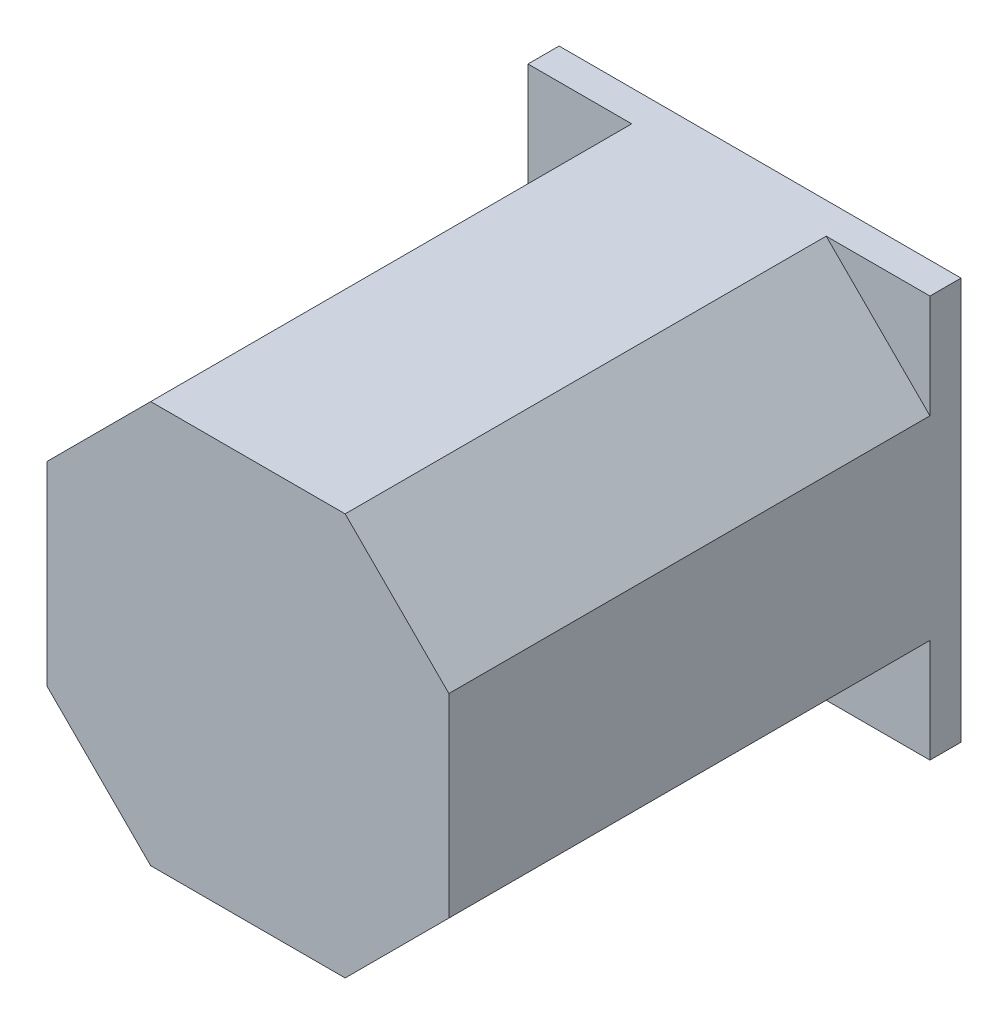
ISO-10303-21;
HEADER;
FILE_DESCRIPTION(('STEP AP214'),'2;1');
FILE_NAME('part.step','',(''),(''),'','','');
FILE_SCHEMA(('AUTOMOTIVE_DESIGN { 1 0 10303 214 1 1 1 1 }'));
ENDSEC;
DATA;
#1=APPLICATION_CONTEXT('core data for automotive mechanical design processes');
#2=APPLICATION_PROTOCOL_DEFINITION('international standard','automotive_design',2000,#1);
#3=PRODUCT_CONTEXT('',#1,'mechanical');
#4=PRODUCT('Part','Part','',(#3));
#5=PRODUCT_RELATED_PRODUCT_CATEGORY('part','',(#4));
#6=PRODUCT_DEFINITION_FORMATION('','',#4);
#7=PRODUCT_DEFINITION_CONTEXT('part definition',#1,'design');
#8=PRODUCT_DEFINITION('design','',#6,#7);
#9=PRODUCT_DEFINITION_SHAPE('','',#8);
#10=(LENGTH_UNIT() NAMED_UNIT(*) SI_UNIT(.MILLI.,.METRE.));
#11=(NAMED_UNIT(*) PLANE_ANGLE_UNIT() SI_UNIT($,.RADIAN.));
#12=(NAMED_UNIT(*) SI_UNIT($,.STERADIAN.) SOLID_ANGLE_UNIT());
#13=UNCERTAINTY_MEASURE_WITH_UNIT(LENGTH_MEASURE(1.E-05),#10,'distance_accuracy_value','');
#14=(GEOMETRIC_REPRESENTATION_CONTEXT(3) GLOBAL_UNCERTAINTY_ASSIGNED_CONTEXT((#13)) GLOBAL_UNIT_ASSIGNED_CONTEXT((#10,
#11,#12)) REPRESENTATION_CONTEXT('',''));
#15=CARTESIAN_POINT('',(0.,0.,0.));
#16=DIRECTION('',(0.,0.,1.));
#17=DIRECTION('',(1.,0.,0.));
#18=AXIS2_PLACEMENT_3D('',#15,#16,#17);
#19=CARTESIAN_POINT('',(0.145154707619999,-0.180380034419988,644.49583871689));
#20=DIRECTION('',(0.,0.,1.));
#21=DIRECTION('',(1.,0.,0.));
#22=AXIS2_PLACEMENT_3D('',#19,#20,#21);
#23=PLANE('',#22);
#24=DIRECTION('',(0.,-1.,0.));
#25=VECTOR('',#24,1.);
#26=CARTESIAN_POINT('',(77.64515470762,-0.180380034419988,644.49583871689));
#27=LINE('',#26,#25);
#28=CARTESIAN_POINT('',(77.64515470762,37.3196199655801,644.49583871689));
#29=VERTEX_POINT('',#28);
#30=CARTESIAN_POINT('',(77.64515470762,-37.68038003442,644.49583871689));
#31=VERTEX_POINT('',#30);
#32=EDGE_CURVE('E135',#29,#31,#27,.T.);
#33=ORIENTED_EDGE('',*,*,#32,.F.);
#34=DIRECTION('',(0.707106781186548,-0.707106781186547,0.));
#35=VECTOR('',#34,1.);
#36=CARTESIAN_POINT('',(57.64515470762,57.3196199655801,644.49583871689));
#37=LINE('',#36,#35);
#38=CARTESIAN_POINT('',(37.64515470762,77.31961996558,644.49583871689));
#39=VERTEX_POINT('',#38);
#40=EDGE_CURVE('E237',#29,#39,#37,.F.);
#41=ORIENTED_EDGE('',*,*,#40,.T.);
#42=DIRECTION('',(1.,0.,0.));
#43=VECTOR('',#42,1.);
#44=CARTESIAN_POINT('',(0.145154707619999,77.31961996558,644.49583871689));
#45=LINE('',#44,#43);
#46=CARTESIAN_POINT('',(-37.35484529238,77.31961996558,644.49583871689));
#47=VERTEX_POINT('',#46);
#48=EDGE_CURVE('E139',#47,#39,#45,.T.);
#49=ORIENTED_EDGE('',*,*,#48,.F.);
#50=DIRECTION('',(0.707106781186548,0.707106781186547,0.));
#51=VECTOR('',#50,1.);
#52=CARTESIAN_POINT('',(-57.35484529238,57.3196199655801,644.49583871689));
#53=LINE('',#52,#51);
#54=CARTESIAN_POINT('',(-77.35484529238,37.3196199655801,644.49583871689));
#55=VERTEX_POINT('',#54);
#56=EDGE_CURVE('E232',#47,#55,#53,.F.);
#57=ORIENTED_EDGE('',*,*,#56,.T.);
#58=DIRECTION('',(0.,1.,0.));
#59=VECTOR('',#58,1.);
#60=CARTESIAN_POINT('',(-77.35484529238,-0.180380034419988,644.49583871689));
#61=LINE('',#60,#59);
#62=CARTESIAN_POINT('',(-77.35484529238,-37.68038003442,644.49583871689));
#63=VERTEX_POINT('',#62);
#64=EDGE_CURVE('E258',#63,#55,#61,.T.);
#65=ORIENTED_EDGE('',*,*,#64,.F.);
#66=DIRECTION('',(-0.707106781186548,0.707106781186547,0.));
#67=VECTOR('',#66,1.);
#68=CARTESIAN_POINT('',(-57.35484529238,-57.68038003442,644.49583871689));
#69=LINE('',#68,#67);
#70=CARTESIAN_POINT('',(-37.35484529238,-77.68038003442,644.49583871689));
#71=VERTEX_POINT('',#70);
#72=EDGE_CURVE('E244',#63,#71,#69,.F.);
#73=ORIENTED_EDGE('',*,*,#72,.T.);
#74=DIRECTION('',(-1.,0.,0.));
#75=VECTOR('',#74,1.);
#76=CARTESIAN_POINT('',(0.145154707619999,-77.68038003442,644.49583871689));
#77=LINE('',#76,#75);
#78=CARTESIAN_POINT('',(37.64515470762,-77.68038003442,644.49583871689));
#79=VERTEX_POINT('',#78);
#80=EDGE_CURVE('E256',#79,#71,#77,.T.);
#81=ORIENTED_EDGE('',*,*,#80,.F.);
#82=DIRECTION('',(-0.707106781186548,-0.707106781186547,0.));
#83=VECTOR('',#82,1.);
#84=CARTESIAN_POINT('',(57.64515470762,-57.68038003442,644.49583871689));
#85=LINE('',#84,#83);
#86=EDGE_CURVE('E240',#79,#31,#85,.F.);
#87=ORIENTED_EDGE('',*,*,#86,.T.);
#88=EDGE_LOOP('',(#33,#41,#49,#57,#65,#73,#81,#87));
#89=FACE_BOUND('',#88,.T.);
#90=ADVANCED_FACE('F16',(#89),#23,.T.);
#91=CARTESIAN_POINT('',(0.145154707619999,-77.68038003442,458.99583871689));
#92=DIRECTION('',(0.,-1.,0.));
#93=DIRECTION('',(0.,0.,-1.));
#94=AXIS2_PLACEMENT_3D('',#91,#92,#93);
#95=PLANE('',#94);
#96=DIRECTION('',(0.,0.,-1.));
#97=VECTOR('',#96,1.);
#98=CARTESIAN_POINT('',(-37.35484529238,-77.68038003442,458.99583871689));
#99=LINE('',#98,#97);
#100=CARTESIAN_POINT('',(-37.35484529238,-77.68038003442,458.99583871689));
#101=VERTEX_POINT('',#100);
#102=EDGE_CURVE('E185',#71,#101,#99,.T.);
#103=ORIENTED_EDGE('',*,*,#102,.T.);
#104=DIRECTION('',(-1.,0.,0.));
#105=VECTOR('',#104,1.);
#106=CARTESIAN_POINT('',(77.64515470762,-77.68038003442,458.99583871689));
#107=LINE('',#106,#105);
#108=CARTESIAN_POINT('',(-77.35484529238,-77.68038003442,458.99583871689));
#109=VERTEX_POINT('',#108);
#110=EDGE_CURVE('E151',#101,#109,#107,.T.);
#111=ORIENTED_EDGE('',*,*,#110,.T.);
#112=DIRECTION('',(0.,0.,-1.));
#113=VECTOR('',#112,1.);
#114=CARTESIAN_POINT('',(-77.35484529238,-77.68038003442,446.99583871689));
#115=LINE('',#114,#113);
#116=CARTESIAN_POINT('',(-77.35484529238,-77.68038003442,446.99583871689));
#117=VERTEX_POINT('',#116);
#118=EDGE_CURVE('E127',#109,#117,#115,.T.);
#119=ORIENTED_EDGE('',*,*,#118,.T.);
#120=DIRECTION('',(-1.,0.,0.));
#121=VECTOR('',#120,1.);
#122=CARTESIAN_POINT('',(77.64515470762,-77.68038003442,446.99583871689));
#123=LINE('',#122,#121);
#124=CARTESIAN_POINT('',(77.64515470762,-77.68038003442,446.99583871689));
#125=VERTEX_POINT('',#124);
#126=EDGE_CURVE('E182',#125,#117,#123,.T.);
#127=ORIENTED_EDGE('',*,*,#126,.F.);
#128=DIRECTION('',(0.,0.,-1.));
#129=VECTOR('',#128,1.);
#130=CARTESIAN_POINT('',(77.64515470762,-77.68038003442,446.99583871689));
#131=LINE('',#130,#129);
#132=CARTESIAN_POINT('',(77.64515470762,-77.68038003442,458.99583871689));
#133=VERTEX_POINT('',#132);
#134=EDGE_CURVE('E152',#133,#125,#131,.T.);
#135=ORIENTED_EDGE('',*,*,#134,.F.);
#136=CARTESIAN_POINT('',(37.64515470762,-77.68038003442,458.99583871689));
#137=VERTEX_POINT('',#136);
#138=EDGE_CURVE('E186',#133,#137,#107,.T.);
#139=ORIENTED_EDGE('',*,*,#138,.T.);
#140=DIRECTION('',(0.,0.,1.));
#141=VECTOR('',#140,1.);
#142=CARTESIAN_POINT('',(37.64515470762,-77.68038003442,458.99583871689));
#143=LINE('',#142,#141);
#144=EDGE_CURVE('E198',#137,#79,#143,.T.);
#145=ORIENTED_EDGE('',*,*,#144,.T.);
#146=ORIENTED_EDGE('',*,*,#80,.T.);
#147=EDGE_LOOP('',(#103,#111,#119,#127,#135,#139,#145,#146));
#148=FACE_BOUND('',#147,.T.);
#149=ADVANCED_FACE('F180',(#148),#95,.T.);
#150=CARTESIAN_POINT('',(-77.35484529238,-0.180380034419988,458.99583871689));
#151=DIRECTION('',(-1.,0.,0.));
#152=DIRECTION('',(0.,0.,1.));
#153=AXIS2_PLACEMENT_3D('',#150,#151,#152);
#154=PLANE('',#153);
#155=DIRECTION('',(0.,0.,-1.));
#156=VECTOR('',#155,1.);
#157=CARTESIAN_POINT('',(-77.35484529238,37.3196199655801,458.99583871689));
#158=LINE('',#157,#156);
#159=CARTESIAN_POINT('',(-77.35484529238,37.3196199655801,458.99583871689));
#160=VERTEX_POINT('',#159);
#161=EDGE_CURVE('E24',#55,#160,#158,.T.);
#162=ORIENTED_EDGE('',*,*,#161,.T.);
#163=DIRECTION('',(0.,-1.,0.));
#164=VECTOR('',#163,1.);
#165=CARTESIAN_POINT('',(-77.35484529238,77.31961996558,458.99583871689));
#166=LINE('',#165,#164);
#167=CARTESIAN_POINT('',(-77.35484529238,77.31961996558,458.99583871689));
#168=VERTEX_POINT('',#167);
#169=EDGE_CURVE('E166',#168,#160,#166,.T.);
#170=ORIENTED_EDGE('',*,*,#169,.F.);
#171=DIRECTION('',(0.,0.,-1.));
#172=VECTOR('',#171,1.);
#173=CARTESIAN_POINT('',(-77.35484529238,77.31961996558,446.99583871689));
#174=LINE('',#173,#172);
#175=CARTESIAN_POINT('',(-77.35484529238,77.31961996558,446.99583871689));
#176=VERTEX_POINT('',#175);
#177=EDGE_CURVE('E141',#168,#176,#174,.T.);
#178=ORIENTED_EDGE('',*,*,#177,.T.);
#179=DIRECTION('',(0.,-1.,0.));
#180=VECTOR('',#179,1.);
#181=CARTESIAN_POINT('',(-77.35484529238,77.31961996558,446.99583871689));
#182=LINE('',#181,#180);
#183=EDGE_CURVE('E148',#176,#117,#182,.T.);
#184=ORIENTED_EDGE('',*,*,#183,.T.);
#185=ORIENTED_EDGE('',*,*,#118,.F.);
#186=CARTESIAN_POINT('',(-77.35484529238,-37.68038003442,458.99583871689));
#187=VERTEX_POINT('',#186);
#188=EDGE_CURVE('E116',#187,#109,#166,.T.);
#189=ORIENTED_EDGE('',*,*,#188,.F.);
#190=DIRECTION('',(0.,0.,1.));
#191=VECTOR('',#190,1.);
#192=CARTESIAN_POINT('',(-77.35484529238,-37.68038003442,458.99583871689));
#193=LINE('',#192,#191);
#194=EDGE_CURVE('E11',#187,#63,#193,.T.);
#195=ORIENTED_EDGE('',*,*,#194,.T.);
#196=ORIENTED_EDGE('',*,*,#64,.T.);
#197=EDGE_LOOP('',(#162,#170,#178,#184,#185,#189,#195,#196));
#198=FACE_BOUND('',#197,.T.);
#199=ADVANCED_FACE('F178',(#198),#154,.T.);
#200=CARTESIAN_POINT('',(0.145154707619999,77.31961996558,458.99583871689));
#201=DIRECTION('',(0.,1.,0.));
#202=DIRECTION('',(0.,0.,1.));
#203=AXIS2_PLACEMENT_3D('',#200,#201,#202);
#204=PLANE('',#203);
#205=ORIENTED_EDGE('',*,*,#48,.T.);
#206=DIRECTION('',(0.,0.,-1.));
#207=VECTOR('',#206,1.);
#208=CARTESIAN_POINT('',(37.64515470762,77.31961996558,458.99583871689));
#209=LINE('',#208,#207);
#210=CARTESIAN_POINT('',(37.64515470762,77.31961996558,458.99583871689));
#211=VERTEX_POINT('',#210);
#212=EDGE_CURVE('E126',#39,#211,#209,.T.);
#213=ORIENTED_EDGE('',*,*,#212,.T.);
#214=DIRECTION('',(-1.,0.,0.));
#215=VECTOR('',#214,1.);
#216=CARTESIAN_POINT('',(77.64515470762,77.31961996558,458.99583871689));
#217=LINE('',#216,#215);
#218=CARTESIAN_POINT('',(77.64515470762,77.31961996558,458.99583871689));
#219=VERTEX_POINT('',#218);
#220=EDGE_CURVE('E110',#219,#211,#217,.T.);
#221=ORIENTED_EDGE('',*,*,#220,.F.);
#222=DIRECTION('',(0.,0.,-1.));
#223=VECTOR('',#222,1.);
#224=CARTESIAN_POINT('',(77.64515470762,77.31961996558,446.99583871689));
#225=LINE('',#224,#223);
#226=CARTESIAN_POINT('',(77.64515470762,77.31961996558,446.99583871689));
#227=VERTEX_POINT('',#226);
#228=EDGE_CURVE('E124',#219,#227,#225,.T.);
#229=ORIENTED_EDGE('',*,*,#228,.T.);
#230=DIRECTION('',(-1.,0.,0.));
#231=VECTOR('',#230,1.);
#232=CARTESIAN_POINT('',(77.64515470762,77.31961996558,446.99583871689));
#233=LINE('',#232,#231);
#234=EDGE_CURVE('E136',#227,#176,#233,.T.);
#235=ORIENTED_EDGE('',*,*,#234,.T.);
#236=ORIENTED_EDGE('',*,*,#177,.F.);
#237=CARTESIAN_POINT('',(-37.3548452923799,77.31961996558,458.99583871689));
#238=VERTEX_POINT('',#237);
#239=EDGE_CURVE('E128',#238,#168,#217,.T.);
#240=ORIENTED_EDGE('',*,*,#239,.F.);
#241=DIRECTION('',(0.,0.,1.));
#242=VECTOR('',#241,1.);
#243=CARTESIAN_POINT('',(-37.35484529238,77.31961996558,458.99583871689));
#244=LINE('',#243,#242);
#245=EDGE_CURVE('E224',#238,#47,#244,.T.);
#246=ORIENTED_EDGE('',*,*,#245,.T.);
#247=EDGE_LOOP('',(#205,#213,#221,#229,#235,#236,#240,#246));
#248=FACE_BOUND('',#247,.T.);
#249=ADVANCED_FACE('F122',(#248),#204,.T.);
#250=CARTESIAN_POINT('',(77.64515470762,-0.180380034419988,458.99583871689));
#251=DIRECTION('',(1.,0.,0.));
#252=DIRECTION('',(0.,0.,-1.));
#253=AXIS2_PLACEMENT_3D('',#250,#251,#252);
#254=PLANE('',#253);
#255=DIRECTION('',(0.,0.,-1.));
#256=VECTOR('',#255,1.);
#257=CARTESIAN_POINT('',(77.64515470762,-37.68038003442,458.99583871689));
#258=LINE('',#257,#256);
#259=CARTESIAN_POINT('',(77.64515470762,-37.68038003442,458.99583871689));
#260=VERTEX_POINT('',#259);
#261=EDGE_CURVE('E233',#31,#260,#258,.T.);
#262=ORIENTED_EDGE('',*,*,#261,.T.);
#263=DIRECTION('',(0.,-1.,0.));
#264=VECTOR('',#263,1.);
#265=CARTESIAN_POINT('',(77.64515470762,77.31961996558,458.99583871689));
#266=LINE('',#265,#264);
#267=EDGE_CURVE('E117',#260,#133,#266,.T.);
#268=ORIENTED_EDGE('',*,*,#267,.T.);
#269=ORIENTED_EDGE('',*,*,#134,.T.);
#270=DIRECTION('',(0.,-1.,0.));
#271=VECTOR('',#270,1.);
#272=CARTESIAN_POINT('',(77.64515470762,77.31961996558,446.99583871689));
#273=LINE('',#272,#271);
#274=EDGE_CURVE('E133',#227,#125,#273,.T.);
#275=ORIENTED_EDGE('',*,*,#274,.F.);
#276=ORIENTED_EDGE('',*,*,#228,.F.);
#277=CARTESIAN_POINT('',(77.64515470762,37.3196199655801,458.99583871689));
#278=VERTEX_POINT('',#277);
#279=EDGE_CURVE('E107',#219,#278,#266,.T.);
#280=ORIENTED_EDGE('',*,*,#279,.T.);
#281=DIRECTION('',(0.,0.,1.));
#282=VECTOR('',#281,1.);
#283=CARTESIAN_POINT('',(77.64515470762,37.3196199655801,458.99583871689));
#284=LINE('',#283,#282);
#285=EDGE_CURVE('E230',#278,#29,#284,.T.);
#286=ORIENTED_EDGE('',*,*,#285,.T.);
#287=ORIENTED_EDGE('',*,*,#32,.T.);
#288=EDGE_LOOP('',(#262,#268,#269,#275,#276,#280,#286,#287));
#289=FACE_BOUND('',#288,.T.);
#290=ADVANCED_FACE('F130',(#289),#254,.T.);
#291=CARTESIAN_POINT('',(77.64515470762,37.3196199655801,458.99583871689));
#292=DIRECTION('',(-0.707106781186547,-0.707106781186548,0.));
#293=DIRECTION('',(0.707106781186548,-0.707106781186547,0.));
#294=AXIS2_PLACEMENT_3D('',#291,#292,#293);
#295=PLANE('',#294);
#296=DIRECTION('',(-0.707106781186548,0.707106781186547,0.));
#297=VECTOR('',#296,1.);
#298=CARTESIAN_POINT('',(57.64515470762,57.3196199655801,458.99583871689));
#299=LINE('',#298,#297);
#300=EDGE_CURVE('E112',#211,#278,#299,.F.);
#301=ORIENTED_EDGE('',*,*,#300,.F.);
#302=ORIENTED_EDGE('',*,*,#212,.F.);
#303=ORIENTED_EDGE('',*,*,#40,.F.);
#304=ORIENTED_EDGE('',*,*,#285,.F.);
#305=EDGE_LOOP('',(#301,#302,#303,#304));
#306=FACE_BOUND('',#305,.T.);
#307=ADVANCED_FACE('F261',(#306),#295,.F.);
#308=CARTESIAN_POINT('',(37.64515470762,-77.68038003442,458.99583871689));
#309=DIRECTION('',(-0.707106781186547,0.707106781186548,0.));
#310=DIRECTION('',(-0.707106781186548,-0.707106781186547,0.));
#311=AXIS2_PLACEMENT_3D('',#308,#309,#310);
#312=PLANE('',#311);
#313=DIRECTION('',(0.707106781186548,0.707106781186547,0.));
#314=VECTOR('',#313,1.);
#315=CARTESIAN_POINT('',(57.64515470762,-57.68038003442,458.99583871689));
#316=LINE('',#315,#314);
#317=EDGE_CURVE('E204',#260,#137,#316,.F.);
#318=ORIENTED_EDGE('',*,*,#317,.F.);
#319=ORIENTED_EDGE('',*,*,#261,.F.);
#320=ORIENTED_EDGE('',*,*,#86,.F.);
#321=ORIENTED_EDGE('',*,*,#144,.F.);
#322=EDGE_LOOP('',(#318,#319,#320,#321));
#323=FACE_BOUND('',#322,.T.);
#324=ADVANCED_FACE('F262',(#323),#312,.F.);
#325=CARTESIAN_POINT('',(-77.35484529238,-37.68038003442,458.99583871689));
#326=DIRECTION('',(0.707106781186547,0.707106781186548,0.));
#327=DIRECTION('',(-0.707106781186548,0.707106781186547,0.));
#328=AXIS2_PLACEMENT_3D('',#325,#326,#327);
#329=PLANE('',#328);
#330=DIRECTION('',(0.707106781186548,-0.707106781186547,0.));
#331=VECTOR('',#330,1.);
#332=CARTESIAN_POINT('',(-57.35484529238,-57.68038003442,458.99583871689));
#333=LINE('',#332,#331);
#334=EDGE_CURVE('E176',#101,#187,#333,.F.);
#335=ORIENTED_EDGE('',*,*,#334,.F.);
#336=ORIENTED_EDGE('',*,*,#102,.F.);
#337=ORIENTED_EDGE('',*,*,#72,.F.);
#338=ORIENTED_EDGE('',*,*,#194,.F.);
#339=EDGE_LOOP('',(#335,#336,#337,#338));
#340=FACE_BOUND('',#339,.T.);
#341=ADVANCED_FACE('F265',(#340),#329,.F.);
#342=CARTESIAN_POINT('',(-37.35484529238,77.31961996558,458.99583871689));
#343=DIRECTION('',(0.707106781186547,-0.707106781186548,0.));
#344=DIRECTION('',(0.707106781186548,0.707106781186547,0.));
#345=AXIS2_PLACEMENT_3D('',#342,#343,#344);
#346=PLANE('',#345);
#347=DIRECTION('',(-0.707106781186548,-0.707106781186547,0.));
#348=VECTOR('',#347,1.);
#349=CARTESIAN_POINT('',(-57.35484529238,57.3196199655801,458.99583871689));
#350=LINE('',#349,#348);
#351=EDGE_CURVE('E209',#160,#238,#350,.F.);
#352=ORIENTED_EDGE('',*,*,#351,.F.);
#353=ORIENTED_EDGE('',*,*,#161,.F.);
#354=ORIENTED_EDGE('',*,*,#56,.F.);
#355=ORIENTED_EDGE('',*,*,#245,.F.);
#356=EDGE_LOOP('',(#352,#353,#354,#355));
#357=FACE_BOUND('',#356,.T.);
#358=ADVANCED_FACE('F272',(#357),#346,.F.);
#359=CARTESIAN_POINT('',(77.64515470762,-77.68038003442,458.99583871689));
#360=DIRECTION('',(0.,0.,1.));
#361=DIRECTION('',(1.,0.,0.));
#362=AXIS2_PLACEMENT_3D('',#359,#360,#361);
#363=PLANE('',#362);
#364=ORIENTED_EDGE('',*,*,#220,.T.);
#365=ORIENTED_EDGE('',*,*,#300,.T.);
#366=ORIENTED_EDGE('',*,*,#279,.F.);
#367=EDGE_LOOP('',(#364,#365,#366));
#368=FACE_BOUND('',#367,.T.);
#369=ADVANCED_FACE('F109',(#368),#363,.T.);
#370=ORIENTED_EDGE('',*,*,#267,.F.);
#371=ORIENTED_EDGE('',*,*,#317,.T.);
#372=ORIENTED_EDGE('',*,*,#138,.F.);
#373=EDGE_LOOP('',(#370,#371,#372));
#374=FACE_BOUND('',#373,.T.);
#375=ADVANCED_FACE('F202',(#374),#363,.T.);
#376=ORIENTED_EDGE('',*,*,#110,.F.);
#377=ORIENTED_EDGE('',*,*,#334,.T.);
#378=ORIENTED_EDGE('',*,*,#188,.T.);
#379=EDGE_LOOP('',(#376,#377,#378));
#380=FACE_BOUND('',#379,.T.);
#381=ADVANCED_FACE('F175',(#380),#363,.T.);
#382=ORIENTED_EDGE('',*,*,#169,.T.);
#383=ORIENTED_EDGE('',*,*,#351,.T.);
#384=ORIENTED_EDGE('',*,*,#239,.T.);
#385=EDGE_LOOP('',(#382,#383,#384));
#386=FACE_BOUND('',#385,.T.);
#387=ADVANCED_FACE('F336',(#386),#363,.T.);
#388=CARTESIAN_POINT('',(77.64515470762,77.31961996558,446.99583871689));
#389=DIRECTION('',(0.,0.,-1.));
#390=DIRECTION('',(-1.,0.,0.));
#391=AXIS2_PLACEMENT_3D('',#388,#389,#390);
#392=PLANE('',#391);
#393=ORIENTED_EDGE('',*,*,#234,.F.);
#394=ORIENTED_EDGE('',*,*,#274,.T.);
#395=ORIENTED_EDGE('',*,*,#126,.T.);
#396=ORIENTED_EDGE('',*,*,#183,.F.);
#397=EDGE_LOOP('',(#393,#394,#395,#396));
#398=FACE_BOUND('',#397,.T.);
#399=ADVANCED_FACE('F194',(#398),#392,.T.);
#400=CLOSED_SHELL('',(#90,#149,#199,#249,#290,#307,#324,#341,#358,#369,#375,#381,#387,#399));
#401=MANIFOLD_SOLID_BREP('B1',#400);
#402=ADVANCED_BREP_SHAPE_REPRESENTATION('',(#18,#401),#14);
#403=SHAPE_DEFINITION_REPRESENTATION(#9,#402);
ENDSEC;
END-ISO-10303-21;
